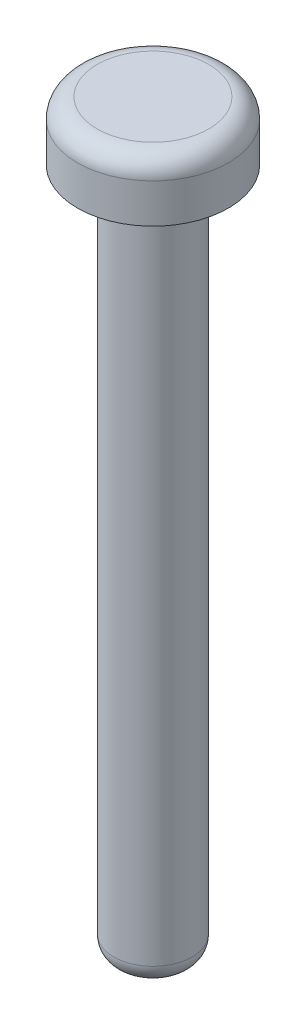
ISO-10303-21;
HEADER;
FILE_DESCRIPTION(('STEP AP214'),'2;1');
FILE_NAME('part.step','',(''),(''),'','','');
FILE_SCHEMA(('AUTOMOTIVE_DESIGN { 1 0 10303 214 1 1 1 1 }'));
ENDSEC;
DATA;
#1=APPLICATION_CONTEXT('core data for automotive mechanical design processes');
#2=APPLICATION_PROTOCOL_DEFINITION('international standard','automotive_design',2000,#1);
#3=PRODUCT_CONTEXT('',#1,'mechanical');
#4=PRODUCT('Part','Part','',(#3));
#5=PRODUCT_RELATED_PRODUCT_CATEGORY('part','',(#4));
#6=PRODUCT_DEFINITION_FORMATION('','',#4);
#7=PRODUCT_DEFINITION_CONTEXT('part definition',#1,'design');
#8=PRODUCT_DEFINITION('design','',#6,#7);
#9=PRODUCT_DEFINITION_SHAPE('','',#8);
#10=(LENGTH_UNIT() NAMED_UNIT(*) SI_UNIT(.MILLI.,.METRE.));
#11=(NAMED_UNIT(*) PLANE_ANGLE_UNIT() SI_UNIT($,.RADIAN.));
#12=(NAMED_UNIT(*) SI_UNIT($,.STERADIAN.) SOLID_ANGLE_UNIT());
#13=UNCERTAINTY_MEASURE_WITH_UNIT(LENGTH_MEASURE(1.E-05),#10,'distance_accuracy_value','');
#14=(GEOMETRIC_REPRESENTATION_CONTEXT(3) GLOBAL_UNCERTAINTY_ASSIGNED_CONTEXT((#13)) GLOBAL_UNIT_ASSIGNED_CONTEXT((#10,
#11,#12)) REPRESENTATION_CONTEXT('',''));
#15=CARTESIAN_POINT('',(0.,0.,0.));
#16=DIRECTION('',(0.,0.,1.));
#17=DIRECTION('',(1.,0.,0.));
#18=AXIS2_PLACEMENT_3D('',#15,#16,#17);
#19=CARTESIAN_POINT('',(0.,35.,0.));
#20=DIRECTION('',(0.,-1.,0.));
#21=DIRECTION('',(0.,0.,-1.));
#22=AXIS2_PLACEMENT_3D('',#19,#20,#21);
#23=CYLINDRICAL_SURFACE('',#22,2.);
#24=CARTESIAN_POINT('',(0.,1.,0.));
#25=DIRECTION('',(0.,1.,0.));
#26=DIRECTION('',(0.,0.,1.));
#27=AXIS2_PLACEMENT_3D('',#24,#25,#26);
#28=CIRCLE('',#27,2.);
#29=CARTESIAN_POINT('',(0.,1.,2.));
#30=VERTEX_POINT('',#29);
#31=EDGE_CURVE('E44',#30,#30,#28,.T.);
#32=ORIENTED_EDGE('',*,*,#31,.T.);
#33=EDGE_LOOP('',(#32));
#34=FACE_BOUND('',#33,.T.);
#35=CARTESIAN_POINT('',(0.,34.,0.));
#36=DIRECTION('',(0.,1.,0.));
#37=DIRECTION('',(0.,0.,1.));
#38=AXIS2_PLACEMENT_3D('',#35,#36,#37);
#39=CIRCLE('',#38,2.);
#40=CARTESIAN_POINT('',(0.,34.,2.));
#41=VERTEX_POINT('',#40);
#42=EDGE_CURVE('E48',#41,#41,#39,.F.);
#43=ORIENTED_EDGE('',*,*,#42,.T.);
#44=EDGE_LOOP('',(#43));
#45=FACE_BOUND('',#44,.T.);
#46=ADVANCED_FACE('F33',(#34,#45),#23,.T.);
#47=CARTESIAN_POINT('',(0.,0.,0.));
#48=DIRECTION('',(0.,1.,0.));
#49=DIRECTION('',(0.,0.,1.));
#50=AXIS2_PLACEMENT_3D('',#47,#48,#49);
#51=PLANE('',#50);
#52=CARTESIAN_POINT('',(0.,0.,0.));
#53=DIRECTION('',(0.,1.,0.));
#54=DIRECTION('',(0.,0.,1.));
#55=AXIS2_PLACEMENT_3D('',#52,#53,#54);
#56=CIRCLE('',#55,1.);
#57=CARTESIAN_POINT('',(0.,0.,1.));
#58=VERTEX_POINT('',#57);
#59=EDGE_CURVE('E40',#58,#58,#56,.F.);
#60=ORIENTED_EDGE('',*,*,#59,.T.);
#61=EDGE_LOOP('',(#60));
#62=FACE_BOUND('',#61,.T.);
#63=ADVANCED_FACE('F81',(#62),#51,.F.);
#64=CARTESIAN_POINT('',(0.,38.,0.));
#65=DIRECTION('',(0.,-1.,0.));
#66=DIRECTION('',(0.,0.,-1.));
#67=AXIS2_PLACEMENT_3D('',#64,#65,#66);
#68=CYLINDRICAL_SURFACE('',#67,3.85);
#69=CARTESIAN_POINT('',(0.,37.,0.));
#70=DIRECTION('',(0.,1.,0.));
#71=DIRECTION('',(0.,0.,1.));
#72=AXIS2_PLACEMENT_3D('',#69,#70,#71);
#73=CIRCLE('',#72,3.85);
#74=CARTESIAN_POINT('',(0.,37.,3.85));
#75=VERTEX_POINT('',#74);
#76=EDGE_CURVE('E53',#75,#75,#73,.F.);
#77=ORIENTED_EDGE('',*,*,#76,.T.);
#78=EDGE_LOOP('',(#77));
#79=FACE_BOUND('',#78,.T.);
#80=CARTESIAN_POINT('',(0.,35.,0.));
#81=DIRECTION('',(0.,1.,0.));
#82=DIRECTION('',(0.,0.,1.));
#83=AXIS2_PLACEMENT_3D('',#80,#81,#82);
#84=CIRCLE('',#83,3.85);
#85=CARTESIAN_POINT('',(0.,35.,3.85));
#86=VERTEX_POINT('',#85);
#87=EDGE_CURVE('E59',#86,#86,#84,.T.);
#88=ORIENTED_EDGE('',*,*,#87,.T.);
#89=EDGE_LOOP('',(#88));
#90=FACE_BOUND('',#89,.T.);
#91=ADVANCED_FACE('F63',(#79,#90),#68,.T.);
#92=CARTESIAN_POINT('',(0.,38.,0.));
#93=DIRECTION('',(0.,1.,0.));
#94=DIRECTION('',(0.,0.,1.));
#95=AXIS2_PLACEMENT_3D('',#92,#93,#94);
#96=PLANE('',#95);
#97=CARTESIAN_POINT('',(0.,38.,0.));
#98=DIRECTION('',(0.,1.,0.));
#99=DIRECTION('',(0.,0.,1.));
#100=AXIS2_PLACEMENT_3D('',#97,#98,#99);
#101=CIRCLE('',#100,2.85);
#102=CARTESIAN_POINT('',(0.,38.,2.85));
#103=VERTEX_POINT('',#102);
#104=EDGE_CURVE('E56',#103,#103,#101,.T.);
#105=ORIENTED_EDGE('',*,*,#104,.T.);
#106=EDGE_LOOP('',(#105));
#107=FACE_BOUND('',#106,.T.);
#108=ADVANCED_FACE('F68',(#107),#96,.T.);
#109=CARTESIAN_POINT('',(0.,35.,0.));
#110=DIRECTION('',(0.,1.,0.));
#111=DIRECTION('',(0.,0.,1.));
#112=AXIS2_PLACEMENT_3D('',#109,#110,#111);
#113=PLANE('',#112);
#114=CARTESIAN_POINT('',(0.,35.,0.));
#115=DIRECTION('',(0.,1.,0.));
#116=DIRECTION('',(0.,0.,1.));
#117=AXIS2_PLACEMENT_3D('',#114,#115,#116);
#118=CIRCLE('',#117,3.);
#119=CARTESIAN_POINT('',(0.,35.,3.));
#120=VERTEX_POINT('',#119);
#121=EDGE_CURVE('E10',#120,#120,#118,.T.);
#122=ORIENTED_EDGE('',*,*,#121,.T.);
#123=EDGE_LOOP('',(#122));
#124=FACE_BOUND('',#123,.T.);
#125=ORIENTED_EDGE('',*,*,#87,.F.);
#126=EDGE_LOOP('',(#125));
#127=FACE_BOUND('',#126,.T.);
#128=ADVANCED_FACE('F65',(#124,#127),#113,.F.);
#129=CARTESIAN_POINT('',(0.,37.,0.));
#130=DIRECTION('',(0.,1.,0.));
#131=DIRECTION('',(0.,0.,1.));
#132=AXIS2_PLACEMENT_3D('',#129,#130,#131);
#133=TOROIDAL_SURFACE('',#132,2.85,1.);
#134=ORIENTED_EDGE('',*,*,#76,.F.);
#135=EDGE_LOOP('',(#134));
#136=FACE_BOUND('',#135,.T.);
#137=ORIENTED_EDGE('',*,*,#104,.F.);
#138=EDGE_LOOP('',(#137));
#139=FACE_BOUND('',#138,.T.);
#140=ADVANCED_FACE('F67',(#136,#139),#133,.T.);
#141=CARTESIAN_POINT('',(0.,1.,0.));
#142=DIRECTION('',(0.,1.,0.));
#143=DIRECTION('',(0.,0.,1.));
#144=AXIS2_PLACEMENT_3D('',#141,#142,#143);
#145=DEGENERATE_TOROIDAL_SURFACE('',#144,1.,1.,.T.);
#146=ORIENTED_EDGE('',*,*,#59,.F.);
#147=EDGE_LOOP('',(#146));
#148=FACE_BOUND('',#147,.T.);
#149=ORIENTED_EDGE('',*,*,#31,.F.);
#150=EDGE_LOOP('',(#149));
#151=FACE_BOUND('',#150,.T.);
#152=ADVANCED_FACE('F74',(#148,#151),#145,.T.);
#153=CARTESIAN_POINT('',(0.,34.,0.));
#154=DIRECTION('',(0.,1.,0.));
#155=DIRECTION('',(0.,0.,1.));
#156=AXIS2_PLACEMENT_3D('',#153,#154,#155);
#157=TOROIDAL_SURFACE('',#156,3.,1.);
#158=ORIENTED_EDGE('',*,*,#42,.F.);
#159=EDGE_LOOP('',(#158));
#160=FACE_BOUND('',#159,.T.);
#161=ORIENTED_EDGE('',*,*,#121,.F.);
#162=EDGE_LOOP('',(#161));
#163=FACE_BOUND('',#162,.T.);
#164=ADVANCED_FACE('F35',(#160,#163),#157,.F.);
#165=CLOSED_SHELL('',(#46,#63,#91,#108,#128,#140,#152,#164));
#166=MANIFOLD_SOLID_BREP('B2',#165);
#167=ADVANCED_BREP_SHAPE_REPRESENTATION('',(#18,#166),#14);
#168=SHAPE_DEFINITION_REPRESENTATION(#9,#167);
ENDSEC;
END-ISO-10303-21;
